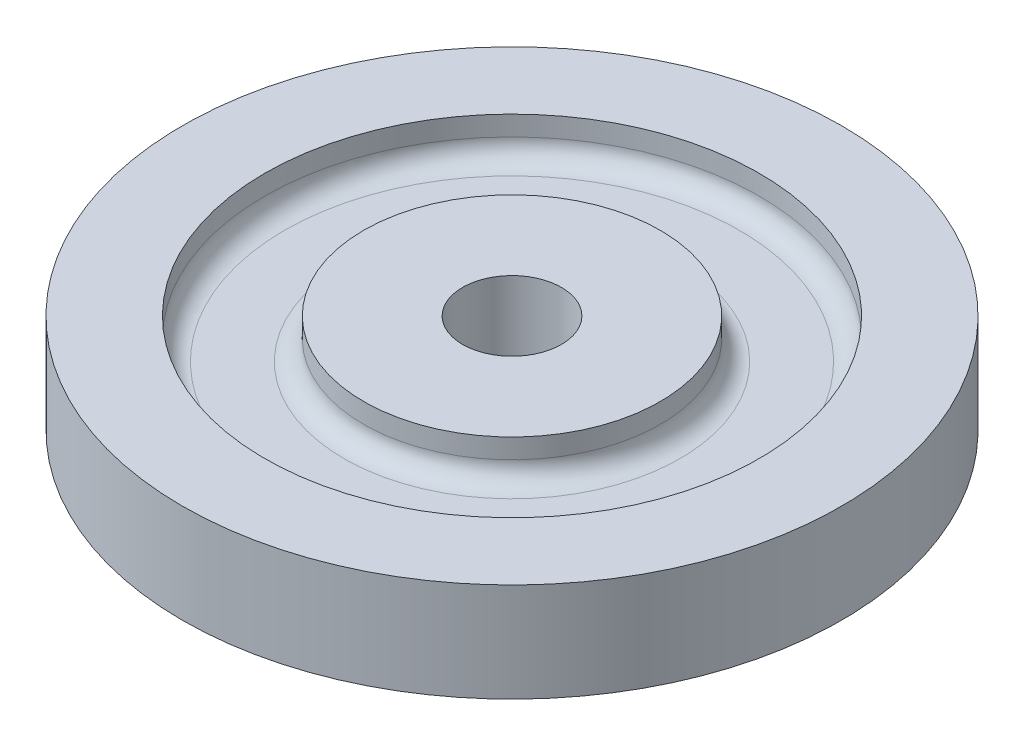
ISO-10303-21;
HEADER;
FILE_DESCRIPTION(('STEP AP214'),'2;1');
FILE_NAME('part.step','',(''),(''),'','','');
FILE_SCHEMA(('AUTOMOTIVE_DESIGN { 1 0 10303 214 1 1 1 1 }'));
ENDSEC;
DATA;
#1=APPLICATION_CONTEXT('core data for automotive mechanical design processes');
#2=APPLICATION_PROTOCOL_DEFINITION('international standard','automotive_design',2000,#1);
#3=PRODUCT_CONTEXT('',#1,'mechanical');
#4=PRODUCT('Part','Part','',(#3));
#5=PRODUCT_RELATED_PRODUCT_CATEGORY('part','',(#4));
#6=PRODUCT_DEFINITION_FORMATION('','',#4);
#7=PRODUCT_DEFINITION_CONTEXT('part definition',#1,'design');
#8=PRODUCT_DEFINITION('design','',#6,#7);
#9=PRODUCT_DEFINITION_SHAPE('','',#8);
#10=(LENGTH_UNIT() NAMED_UNIT(*) SI_UNIT(.MILLI.,.METRE.));
#11=(NAMED_UNIT(*) PLANE_ANGLE_UNIT() SI_UNIT($,.RADIAN.));
#12=(NAMED_UNIT(*) SI_UNIT($,.STERADIAN.) SOLID_ANGLE_UNIT());
#13=UNCERTAINTY_MEASURE_WITH_UNIT(LENGTH_MEASURE(1.E-05),#10,'distance_accuracy_value','');
#14=(GEOMETRIC_REPRESENTATION_CONTEXT(3) GLOBAL_UNCERTAINTY_ASSIGNED_CONTEXT((#13)) GLOBAL_UNIT_ASSIGNED_CONTEXT((#10,
#11,#12)) REPRESENTATION_CONTEXT('',''));
#15=CARTESIAN_POINT('',(0.,0.,0.));
#16=DIRECTION('',(0.,0.,1.));
#17=DIRECTION('',(1.,0.,0.));
#18=AXIS2_PLACEMENT_3D('',#15,#16,#17);
#19=CARTESIAN_POINT('',(0.,12.7,0.));
#20=DIRECTION('',(0.,1.,0.));
#21=DIRECTION('',(0.,0.,1.));
#22=AXIS2_PLACEMENT_3D('',#19,#20,#21);
#23=PLANE('',#22);
#24=CARTESIAN_POINT('',(0.,12.7,0.));
#25=DIRECTION('',(0.,1.,0.));
#26=DIRECTION('',(-1.,0.,0.));
#27=AXIS2_PLACEMENT_3D('',#24,#25,#26);
#28=CIRCLE('',#27,19.05);
#29=CARTESIAN_POINT('',(-19.05,12.7,0.));
#30=VERTEX_POINT('',#29);
#31=EDGE_CURVE('E112',#30,#30,#28,.T.);
#32=ORIENTED_EDGE('',*,*,#31,.T.);
#33=EDGE_LOOP('',(#32));
#34=FACE_BOUND('',#33,.T.);
#35=CARTESIAN_POINT('',(0.,12.7,0.));
#36=DIRECTION('',(0.,1.,0.));
#37=DIRECTION('',(0.,0.,1.));
#38=AXIS2_PLACEMENT_3D('',#35,#36,#37);
#39=CIRCLE('',#38,6.35);
#40=CARTESIAN_POINT('',(0.,12.7,6.35));
#41=VERTEX_POINT('',#40);
#42=EDGE_CURVE('E119',#41,#41,#39,.T.);
#43=ORIENTED_EDGE('',*,*,#42,.F.);
#44=EDGE_LOOP('',(#43));
#45=FACE_BOUND('',#44,.T.);
#46=ADVANCED_FACE('F45',(#34,#45),#23,.T.);
#47=CARTESIAN_POINT('',(0.,12.7,0.));
#48=DIRECTION('',(0.,1.,0.));
#49=DIRECTION('',(-1.,0.,0.));
#50=AXIS2_PLACEMENT_3D('',#47,#48,#49);
#51=CIRCLE('',#50,31.75);
#52=CARTESIAN_POINT('',(-31.75,12.7,0.));
#53=VERTEX_POINT('',#52);
#54=EDGE_CURVE('E88',#53,#53,#51,.T.);
#55=ORIENTED_EDGE('',*,*,#54,.F.);
#56=EDGE_LOOP('',(#55));
#57=FACE_BOUND('',#56,.T.);
#58=CARTESIAN_POINT('',(0.,12.7,0.));
#59=DIRECTION('',(0.,1.,0.));
#60=DIRECTION('',(0.,0.,1.));
#61=AXIS2_PLACEMENT_3D('',#58,#59,#60);
#62=CIRCLE('',#61,42.3291);
#63=CARTESIAN_POINT('',(0.,12.7,42.3291));
#64=VERTEX_POINT('',#63);
#65=EDGE_CURVE('E12',#64,#64,#62,.T.);
#66=ORIENTED_EDGE('',*,*,#65,.T.);
#67=EDGE_LOOP('',(#66));
#68=FACE_BOUND('',#67,.T.);
#69=ADVANCED_FACE('F143',(#57,#68),#23,.T.);
#70=CARTESIAN_POINT('',(0.,0.,0.));
#71=DIRECTION('',(0.,1.,0.));
#72=DIRECTION('',(0.,0.,1.));
#73=AXIS2_PLACEMENT_3D('',#70,#71,#72);
#74=PLANE('',#73);
#75=CARTESIAN_POINT('',(0.,0.,0.));
#76=DIRECTION('',(0.,1.,0.));
#77=DIRECTION('',(0.,0.,1.));
#78=AXIS2_PLACEMENT_3D('',#75,#76,#77);
#79=CIRCLE('',#78,42.3291);
#80=CARTESIAN_POINT('',(0.,0.,42.3291));
#81=VERTEX_POINT('',#80);
#82=EDGE_CURVE('E49',#81,#81,#79,.T.);
#83=ORIENTED_EDGE('',*,*,#82,.F.);
#84=EDGE_LOOP('',(#83));
#85=FACE_BOUND('',#84,.T.);
#86=CARTESIAN_POINT('',(0.,0.,0.));
#87=DIRECTION('',(0.,1.,0.));
#88=DIRECTION('',(0.,0.,1.));
#89=AXIS2_PLACEMENT_3D('',#86,#87,#88);
#90=CIRCLE('',#89,6.35);
#91=CARTESIAN_POINT('',(0.,0.,6.35));
#92=VERTEX_POINT('',#91);
#93=EDGE_CURVE('E118',#92,#92,#90,.T.);
#94=ORIENTED_EDGE('',*,*,#93,.T.);
#95=EDGE_LOOP('',(#94));
#96=FACE_BOUND('',#95,.T.);
#97=ADVANCED_FACE('F127',(#85,#96),#74,.F.);
#98=CARTESIAN_POINT('',(0.,12.7,0.));
#99=DIRECTION('',(0.,-1.,0.));
#100=DIRECTION('',(0.,0.,-1.));
#101=AXIS2_PLACEMENT_3D('',#98,#99,#100);
#102=CYLINDRICAL_SURFACE('',#101,42.3291);
#103=ORIENTED_EDGE('',*,*,#65,.F.);
#104=EDGE_LOOP('',(#103));
#105=FACE_BOUND('',#104,.T.);
#106=ORIENTED_EDGE('',*,*,#82,.T.);
#107=EDGE_LOOP('',(#106));
#108=FACE_BOUND('',#107,.T.);
#109=ADVANCED_FACE('F47',(#105,#108),#102,.T.);
#110=CARTESIAN_POINT('',(0.,12.7,0.));
#111=DIRECTION('',(0.,-1.,0.));
#112=DIRECTION('',(0.,0.,-1.));
#113=AXIS2_PLACEMENT_3D('',#110,#111,#112);
#114=CYLINDRICAL_SURFACE('',#113,6.35);
#115=ORIENTED_EDGE('',*,*,#42,.T.);
#116=EDGE_LOOP('',(#115));
#117=FACE_BOUND('',#116,.T.);
#118=ORIENTED_EDGE('',*,*,#93,.F.);
#119=EDGE_LOOP('',(#118));
#120=FACE_BOUND('',#119,.T.);
#121=ADVANCED_FACE('F129',(#117,#120),#114,.F.);
#122=CARTESIAN_POINT('',(0.,12.7,0.));
#123=DIRECTION('',(0.,1.,0.));
#124=DIRECTION('',(0.,0.,1.));
#125=AXIS2_PLACEMENT_3D('',#122,#123,#124);
#126=CYLINDRICAL_SURFACE('',#125,19.05);
#127=DIRECTION('',(0.,1.,0.));
#128=VECTOR('',#127,1.);
#129=CARTESIAN_POINT('',(-19.05,12.7,0.));
#130=LINE('',#129,#128);
#131=CARTESIAN_POINT('',(-19.05,10.16,0.));
#132=VERTEX_POINT('',#131);
#133=EDGE_CURVE('E61',#132,#30,#130,.T.);
#134=ORIENTED_EDGE('',*,*,#133,.T.);
#135=ORIENTED_EDGE('',*,*,#31,.F.);
#136=ORIENTED_EDGE('',*,*,#133,.F.);
#137=CARTESIAN_POINT('',(0.,10.16,0.));
#138=DIRECTION('',(0.,1.,0.));
#139=DIRECTION('',(-1.,0.,0.));
#140=AXIS2_PLACEMENT_3D('',#137,#138,#139);
#141=CIRCLE('',#140,19.05);
#142=EDGE_CURVE('E106',#132,#132,#141,.T.);
#143=ORIENTED_EDGE('',*,*,#142,.T.);
#144=EDGE_LOOP('',(#134,#135,#136,#143));
#145=FACE_BOUND('',#144,.T.);
#146=ADVANCED_FACE('F131',(#145),#126,.T.);
#147=CARTESIAN_POINT('',(0.,10.16,0.));
#148=DIRECTION('',(0.,1.,0.));
#149=DIRECTION('',(0.,0.,1.));
#150=AXIS2_PLACEMENT_3D('',#147,#148,#149);
#151=TOROIDAL_SURFACE('',#150,21.59,2.54);
#152=CARTESIAN_POINT('',(-21.59,10.16,0.));
#153=DIRECTION('',(0.,0.,1.));
#154=DIRECTION('',(1.,0.,0.));
#155=AXIS2_PLACEMENT_3D('',#152,#153,#154);
#156=CIRCLE('',#155,2.54);
#157=CARTESIAN_POINT('',(-21.59,7.62,0.));
#158=VERTEX_POINT('',#157);
#159=EDGE_CURVE('E103',#158,#132,#156,.T.);
#160=ORIENTED_EDGE('',*,*,#159,.T.);
#161=ORIENTED_EDGE('',*,*,#142,.F.);
#162=ORIENTED_EDGE('',*,*,#159,.F.);
#163=CARTESIAN_POINT('',(0.,7.62,0.));
#164=DIRECTION('',(0.,1.,0.));
#165=DIRECTION('',(-1.,0.,0.));
#166=AXIS2_PLACEMENT_3D('',#163,#164,#165);
#167=CIRCLE('',#166,21.59);
#168=EDGE_CURVE('E92',#158,#158,#167,.T.);
#169=ORIENTED_EDGE('',*,*,#168,.T.);
#170=EDGE_LOOP('',(#160,#161,#162,#169));
#171=FACE_BOUND('',#170,.T.);
#172=ADVANCED_FACE('F138',(#171),#151,.F.);
#173=CARTESIAN_POINT('',(-29.21,7.62,0.));
#174=DIRECTION('',(0.,-1.,0.));
#175=DIRECTION('',(0.,0.,-1.));
#176=AXIS2_PLACEMENT_3D('',#173,#174,#175);
#177=PLANE('',#176);
#178=CARTESIAN_POINT('',(0.,7.62,0.));
#179=DIRECTION('',(0.,1.,0.));
#180=DIRECTION('',(-1.,0.,0.));
#181=AXIS2_PLACEMENT_3D('',#178,#179,#180);
#182=CIRCLE('',#181,29.21);
#183=CARTESIAN_POINT('',(-29.21,7.62,0.));
#184=VERTEX_POINT('',#183);
#185=EDGE_CURVE('E87',#184,#184,#182,.T.);
#186=ORIENTED_EDGE('',*,*,#185,.T.);
#187=EDGE_LOOP('',(#186));
#188=FACE_BOUND('',#187,.T.);
#189=ORIENTED_EDGE('',*,*,#168,.F.);
#190=EDGE_LOOP('',(#189));
#191=FACE_BOUND('',#190,.T.);
#192=ADVANCED_FACE('F191',(#188,#191),#177,.F.);
#193=CARTESIAN_POINT('',(0.,10.16,0.));
#194=DIRECTION('',(0.,1.,0.));
#195=DIRECTION('',(0.,0.,1.));
#196=AXIS2_PLACEMENT_3D('',#193,#194,#195);
#197=TOROIDAL_SURFACE('',#196,29.21,2.54);
#198=CARTESIAN_POINT('',(-29.21,10.16,0.));
#199=DIRECTION('',(0.,0.,1.));
#200=DIRECTION('',(1.,0.,0.));
#201=AXIS2_PLACEMENT_3D('',#198,#199,#200);
#202=CIRCLE('',#201,2.54);
#203=CARTESIAN_POINT('',(-31.75,10.16,0.));
#204=VERTEX_POINT('',#203);
#205=EDGE_CURVE('E85',#204,#184,#202,.T.);
#206=ORIENTED_EDGE('',*,*,#205,.T.);
#207=ORIENTED_EDGE('',*,*,#185,.F.);
#208=ORIENTED_EDGE('',*,*,#205,.F.);
#209=CARTESIAN_POINT('',(0.,10.16,0.));
#210=DIRECTION('',(0.,1.,0.));
#211=DIRECTION('',(-1.,0.,0.));
#212=AXIS2_PLACEMENT_3D('',#209,#210,#211);
#213=CIRCLE('',#212,31.75);
#214=EDGE_CURVE('E82',#204,#204,#213,.T.);
#215=ORIENTED_EDGE('',*,*,#214,.T.);
#216=EDGE_LOOP('',(#206,#207,#208,#215));
#217=FACE_BOUND('',#216,.T.);
#218=ADVANCED_FACE('F83',(#217),#197,.F.);
#219=CARTESIAN_POINT('',(0.,12.7,0.));
#220=DIRECTION('',(0.,1.,0.));
#221=DIRECTION('',(0.,0.,1.));
#222=AXIS2_PLACEMENT_3D('',#219,#220,#221);
#223=CYLINDRICAL_SURFACE('',#222,31.75);
#224=DIRECTION('',(0.,-1.,0.));
#225=VECTOR('',#224,1.);
#226=CARTESIAN_POINT('',(-31.75,12.7,0.));
#227=LINE('',#226,#225);
#228=EDGE_CURVE('E68',#53,#204,#227,.T.);
#229=ORIENTED_EDGE('',*,*,#228,.T.);
#230=ORIENTED_EDGE('',*,*,#214,.F.);
#231=ORIENTED_EDGE('',*,*,#228,.F.);
#232=ORIENTED_EDGE('',*,*,#54,.T.);
#233=EDGE_LOOP('',(#229,#230,#231,#232));
#234=FACE_BOUND('',#233,.T.);
#235=ADVANCED_FACE('F210',(#234),#223,.F.);
#236=CLOSED_SHELL('',(#46,#69,#97,#109,#121,#146,#172,#192,#218,#235));
#237=MANIFOLD_SOLID_BREP('B2',#236);
#238=ADVANCED_BREP_SHAPE_REPRESENTATION('',(#18,#237),#14);
#239=SHAPE_DEFINITION_REPRESENTATION(#9,#238);
ENDSEC;
END-ISO-10303-21;
